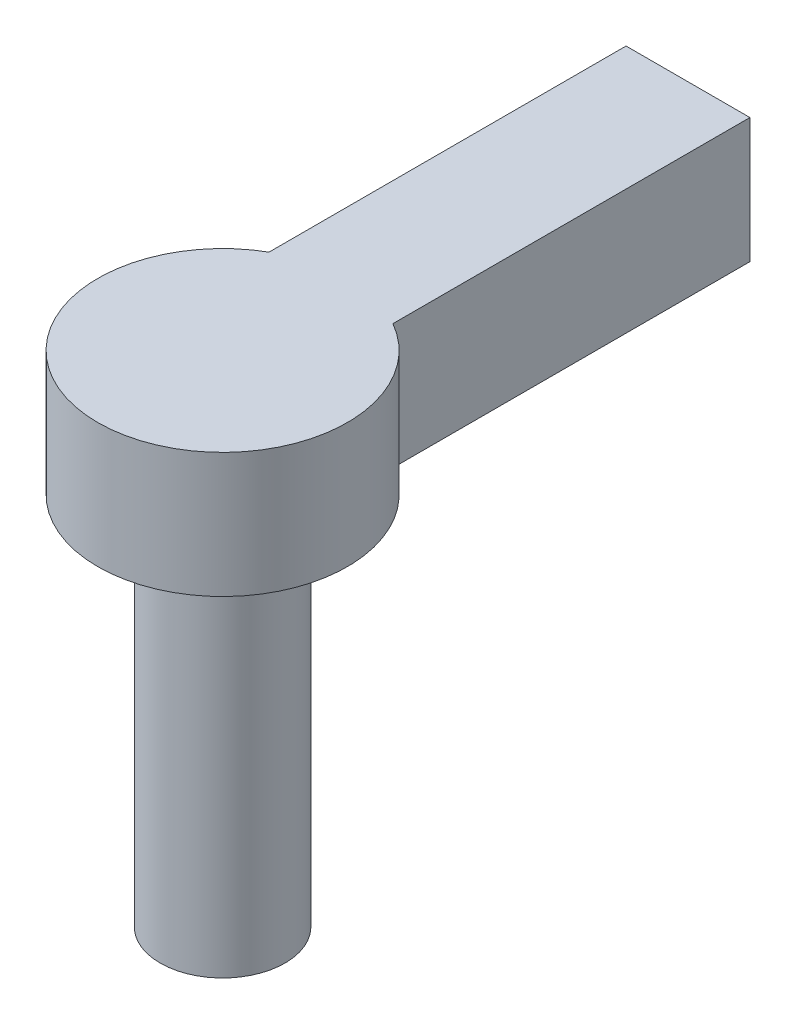
ISO-10303-21;
HEADER;
FILE_DESCRIPTION(('STEP AP214'),'2;1');
FILE_NAME('part.step','',(''),(''),'','','');
FILE_SCHEMA(('AUTOMOTIVE_DESIGN { 1 0 10303 214 1 1 1 1 }'));
ENDSEC;
DATA;
#1=APPLICATION_CONTEXT('core data for automotive mechanical design processes');
#2=APPLICATION_PROTOCOL_DEFINITION('international standard','automotive_design',2000,#1);
#3=PRODUCT_CONTEXT('',#1,'mechanical');
#4=PRODUCT('Part','Part','',(#3));
#5=PRODUCT_RELATED_PRODUCT_CATEGORY('part','',(#4));
#6=PRODUCT_DEFINITION_FORMATION('','',#4);
#7=PRODUCT_DEFINITION_CONTEXT('part definition',#1,'design');
#8=PRODUCT_DEFINITION('design','',#6,#7);
#9=PRODUCT_DEFINITION_SHAPE('','',#8);
#10=(LENGTH_UNIT() NAMED_UNIT(*) SI_UNIT(.MILLI.,.METRE.));
#11=(NAMED_UNIT(*) PLANE_ANGLE_UNIT() SI_UNIT($,.RADIAN.));
#12=(NAMED_UNIT(*) SI_UNIT($,.STERADIAN.) SOLID_ANGLE_UNIT());
#13=UNCERTAINTY_MEASURE_WITH_UNIT(LENGTH_MEASURE(1.E-05),#10,'distance_accuracy_value','');
#14=(GEOMETRIC_REPRESENTATION_CONTEXT(3) GLOBAL_UNCERTAINTY_ASSIGNED_CONTEXT((#13)) GLOBAL_UNIT_ASSIGNED_CONTEXT((#10,
#11,#12)) REPRESENTATION_CONTEXT('',''));
#15=CARTESIAN_POINT('',(0.,0.,0.));
#16=DIRECTION('',(0.,0.,1.));
#17=DIRECTION('',(1.,0.,0.));
#18=AXIS2_PLACEMENT_3D('',#15,#16,#17);
#19=CARTESIAN_POINT('',(0.,19.05,0.));
#20=DIRECTION('',(0.,-1.,0.));
#21=DIRECTION('',(0.,0.,-1.));
#22=AXIS2_PLACEMENT_3D('',#19,#20,#21);
#23=CYLINDRICAL_SURFACE('',#22,3.175);
#24=CARTESIAN_POINT('',(0.,19.05,0.));
#25=DIRECTION('',(0.,1.,0.));
#26=DIRECTION('',(0.,0.,1.));
#27=AXIS2_PLACEMENT_3D('',#24,#25,#26);
#28=CIRCLE('',#27,3.175);
#29=CARTESIAN_POINT('',(0.,19.05,3.175));
#30=VERTEX_POINT('',#29);
#31=EDGE_CURVE('E11',#30,#30,#28,.T.);
#32=ORIENTED_EDGE('',*,*,#31,.F.);
#33=EDGE_LOOP('',(#32));
#34=FACE_BOUND('',#33,.T.);
#35=CARTESIAN_POINT('',(0.,0.,0.));
#36=DIRECTION('',(0.,1.,0.));
#37=DIRECTION('',(0.,0.,1.));
#38=AXIS2_PLACEMENT_3D('',#35,#36,#37);
#39=CIRCLE('',#38,3.175);
#40=CARTESIAN_POINT('',(0.,0.,3.175));
#41=VERTEX_POINT('',#40);
#42=EDGE_CURVE('E36',#41,#41,#39,.T.);
#43=ORIENTED_EDGE('',*,*,#42,.T.);
#44=EDGE_LOOP('',(#43));
#45=FACE_BOUND('',#44,.T.);
#46=ADVANCED_FACE('F33',(#34,#45),#23,.T.);
#47=CARTESIAN_POINT('',(0.,0.,0.));
#48=DIRECTION('',(0.,1.,0.));
#49=DIRECTION('',(0.,0.,1.));
#50=AXIS2_PLACEMENT_3D('',#47,#48,#49);
#51=PLANE('',#50);
#52=ORIENTED_EDGE('',*,*,#42,.F.);
#53=EDGE_LOOP('',(#52));
#54=FACE_BOUND('',#53,.T.);
#55=ADVANCED_FACE('F112',(#54),#51,.F.);
#56=CARTESIAN_POINT('',(0.,25.4,0.));
#57=DIRECTION('',(0.,-1.,0.));
#58=DIRECTION('',(0.,0.,-1.));
#59=AXIS2_PLACEMENT_3D('',#56,#57,#58);
#60=CYLINDRICAL_SURFACE('',#59,6.35);
#61=CARTESIAN_POINT('',(0.,19.05,0.));
#62=DIRECTION('',(0.,1.,0.));
#63=DIRECTION('',(0.,0.,1.));
#64=AXIS2_PLACEMENT_3D('',#61,#62,#63);
#65=CIRCLE('',#64,6.35);
#66=CARTESIAN_POINT('',(-3.15028216458657,19.05,-5.51345828709058));
#67=VERTEX_POINT('',#66);
#68=CARTESIAN_POINT('',(3.15028216458657,19.05,-5.51345828709058));
#69=VERTEX_POINT('',#68);
#70=EDGE_CURVE('E83',#67,#69,#65,.T.);
#71=ORIENTED_EDGE('',*,*,#70,.T.);
#72=DIRECTION('',(0.,-1.,0.));
#73=VECTOR('',#72,1.);
#74=CARTESIAN_POINT('',(3.15028216458657,25.4,-5.51345828709058));
#75=LINE('',#74,#73);
#76=CARTESIAN_POINT('',(3.15028216458657,25.4,-5.51345828709058));
#77=VERTEX_POINT('',#76);
#78=EDGE_CURVE('E80',#77,#69,#75,.T.);
#79=ORIENTED_EDGE('',*,*,#78,.F.);
#80=CARTESIAN_POINT('',(0.,25.4,0.));
#81=DIRECTION('',(0.,1.,0.));
#82=DIRECTION('',(0.,0.,1.));
#83=AXIS2_PLACEMENT_3D('',#80,#81,#82);
#84=CIRCLE('',#83,6.35);
#85=CARTESIAN_POINT('',(-3.15028216458657,25.4,-5.51345828709058));
#86=VERTEX_POINT('',#85);
#87=EDGE_CURVE('E99',#86,#77,#84,.T.);
#88=ORIENTED_EDGE('',*,*,#87,.F.);
#89=DIRECTION('',(0.,-1.,0.));
#90=VECTOR('',#89,1.);
#91=CARTESIAN_POINT('',(-3.15028216458657,25.4,-5.51345828709058));
#92=LINE('',#91,#90);
#93=EDGE_CURVE('E103',#86,#67,#92,.T.);
#94=ORIENTED_EDGE('',*,*,#93,.T.);
#95=EDGE_LOOP('',(#71,#79,#88,#94));
#96=FACE_BOUND('',#95,.T.);
#97=ADVANCED_FACE('F114',(#96),#60,.T.);
#98=CARTESIAN_POINT('',(3.15028216458657,25.4,-5.51345828709058));
#99=DIRECTION('',(-1.,0.,0.));
#100=DIRECTION('',(0.,0.,1.));
#101=AXIS2_PLACEMENT_3D('',#98,#99,#100);
#102=PLANE('',#101);
#103=DIRECTION('',(0.,0.,-1.));
#104=VECTOR('',#103,1.);
#105=CARTESIAN_POINT('',(3.15028216458657,19.05,-5.51345828709058));
#106=LINE('',#105,#104);
#107=CARTESIAN_POINT('',(3.15028216458657,19.05,-23.6720299881124));
#108=VERTEX_POINT('',#107);
#109=EDGE_CURVE('E61',#69,#108,#106,.T.);
#110=ORIENTED_EDGE('',*,*,#109,.T.);
#111=DIRECTION('',(0.,-1.,0.));
#112=VECTOR('',#111,1.);
#113=CARTESIAN_POINT('',(3.15028216458657,25.4,-23.6720299881124));
#114=LINE('',#113,#112);
#115=CARTESIAN_POINT('',(3.15028216458657,25.4,-23.6720299881124));
#116=VERTEX_POINT('',#115);
#117=EDGE_CURVE('E78',#116,#108,#114,.T.);
#118=ORIENTED_EDGE('',*,*,#117,.F.);
#119=DIRECTION('',(0.,0.,-1.));
#120=VECTOR('',#119,1.);
#121=CARTESIAN_POINT('',(3.15028216458657,25.4,-5.51345828709058));
#122=LINE('',#121,#120);
#123=EDGE_CURVE('E66',#77,#116,#122,.T.);
#124=ORIENTED_EDGE('',*,*,#123,.F.);
#125=ORIENTED_EDGE('',*,*,#78,.T.);
#126=EDGE_LOOP('',(#110,#118,#124,#125));
#127=FACE_BOUND('',#126,.T.);
#128=ADVANCED_FACE('F76',(#127),#102,.F.);
#129=CARTESIAN_POINT('',(-3.15028216458657,25.4,-5.51345828709058));
#130=DIRECTION('',(1.,0.,0.));
#131=DIRECTION('',(0.,0.,-1.));
#132=AXIS2_PLACEMENT_3D('',#129,#130,#131);
#133=PLANE('',#132);
#134=DIRECTION('',(0.,0.,1.));
#135=VECTOR('',#134,1.);
#136=CARTESIAN_POINT('',(-3.15028216458657,19.05,-5.51345828709058));
#137=LINE('',#136,#135);
#138=CARTESIAN_POINT('',(-3.15028216458657,19.05,-23.6720299881124));
#139=VERTEX_POINT('',#138);
#140=EDGE_CURVE('E82',#139,#67,#137,.T.);
#141=ORIENTED_EDGE('',*,*,#140,.T.);
#142=ORIENTED_EDGE('',*,*,#93,.F.);
#143=DIRECTION('',(0.,0.,1.));
#144=VECTOR('',#143,1.);
#145=CARTESIAN_POINT('',(-3.15028216458657,25.4,-5.51345828709058));
#146=LINE('',#145,#144);
#147=CARTESIAN_POINT('',(-3.15028216458657,25.4,-23.6720299881124));
#148=VERTEX_POINT('',#147);
#149=EDGE_CURVE('E49',#148,#86,#146,.T.);
#150=ORIENTED_EDGE('',*,*,#149,.F.);
#151=DIRECTION('',(0.,1.,0.));
#152=VECTOR('',#151,1.);
#153=CARTESIAN_POINT('',(-3.15028216458657,19.05,-23.6720299881124));
#154=LINE('',#153,#152);
#155=EDGE_CURVE('E91',#139,#148,#154,.T.);
#156=ORIENTED_EDGE('',*,*,#155,.F.);
#157=EDGE_LOOP('',(#141,#142,#150,#156));
#158=FACE_BOUND('',#157,.T.);
#159=ADVANCED_FACE('F125',(#158),#133,.F.);
#160=CARTESIAN_POINT('',(0.,25.4,0.));
#161=DIRECTION('',(0.,1.,0.));
#162=DIRECTION('',(0.,0.,1.));
#163=AXIS2_PLACEMENT_3D('',#160,#161,#162);
#164=PLANE('',#163);
#165=ORIENTED_EDGE('',*,*,#87,.T.);
#166=ORIENTED_EDGE('',*,*,#123,.T.);
#167=DIRECTION('',(1.,0.,0.));
#168=VECTOR('',#167,1.);
#169=CARTESIAN_POINT('',(-3.15028216458657,25.4,-23.6720299881124));
#170=LINE('',#169,#168);
#171=EDGE_CURVE('E94',#148,#116,#170,.T.);
#172=ORIENTED_EDGE('',*,*,#171,.F.);
#173=ORIENTED_EDGE('',*,*,#149,.T.);
#174=EDGE_LOOP('',(#165,#166,#172,#173));
#175=FACE_BOUND('',#174,.T.);
#176=ADVANCED_FACE('F128',(#175),#164,.T.);
#177=CARTESIAN_POINT('',(0.,19.05,0.));
#178=DIRECTION('',(0.,1.,0.));
#179=DIRECTION('',(0.,0.,1.));
#180=AXIS2_PLACEMENT_3D('',#177,#178,#179);
#181=PLANE('',#180);
#182=ORIENTED_EDGE('',*,*,#31,.T.);
#183=EDGE_LOOP('',(#182));
#184=FACE_BOUND('',#183,.T.);
#185=ORIENTED_EDGE('',*,*,#70,.F.);
#186=ORIENTED_EDGE('',*,*,#140,.F.);
#187=DIRECTION('',(-1.,0.,0.));
#188=VECTOR('',#187,1.);
#189=CARTESIAN_POINT('',(3.15028216458657,19.05,-23.6720299881124));
#190=LINE('',#189,#188);
#191=EDGE_CURVE('E86',#108,#139,#190,.T.);
#192=ORIENTED_EDGE('',*,*,#191,.F.);
#193=ORIENTED_EDGE('',*,*,#109,.F.);
#194=EDGE_LOOP('',(#185,#186,#192,#193));
#195=FACE_BOUND('',#194,.T.);
#196=ADVANCED_FACE('F87',(#184,#195),#181,.F.);
#197=CARTESIAN_POINT('',(0.,0.,-23.6720299881124));
#198=DIRECTION('',(0.,0.,-1.));
#199=DIRECTION('',(-1.,0.,0.));
#200=AXIS2_PLACEMENT_3D('',#197,#198,#199);
#201=PLANE('',#200);
#202=ORIENTED_EDGE('',*,*,#117,.T.);
#203=ORIENTED_EDGE('',*,*,#191,.T.);
#204=ORIENTED_EDGE('',*,*,#155,.T.);
#205=ORIENTED_EDGE('',*,*,#171,.T.);
#206=EDGE_LOOP('',(#202,#203,#204,#205));
#207=FACE_BOUND('',#206,.T.);
#208=ADVANCED_FACE('F93',(#207),#201,.T.);
#209=CLOSED_SHELL('',(#46,#55,#97,#128,#159,#176,#196,#208));
#210=MANIFOLD_SOLID_BREP('B2',#209);
#211=ADVANCED_BREP_SHAPE_REPRESENTATION('',(#18,#210),#14);
#212=SHAPE_DEFINITION_REPRESENTATION(#9,#211);
ENDSEC;
END-ISO-10303-21;
